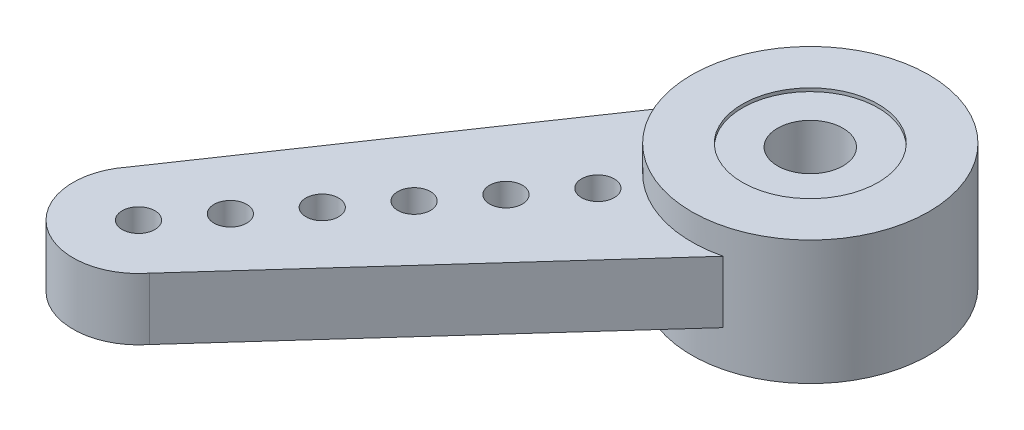
ISO-10303-21;
HEADER;
FILE_DESCRIPTION(('STEP AP214'),'2;1');
FILE_NAME('part.step','',(''),(''),'','','');
FILE_SCHEMA(('AUTOMOTIVE_DESIGN { 1 0 10303 214 1 1 1 1 }'));
ENDSEC;
DATA;
#1=APPLICATION_CONTEXT('core data for automotive mechanical design processes');
#2=APPLICATION_PROTOCOL_DEFINITION('international standard','automotive_design',2000,#1);
#3=PRODUCT_CONTEXT('',#1,'mechanical');
#4=PRODUCT('Part','Part','',(#3));
#5=PRODUCT_RELATED_PRODUCT_CATEGORY('part','',(#4));
#6=PRODUCT_DEFINITION_FORMATION('','',#4);
#7=PRODUCT_DEFINITION_CONTEXT('part definition',#1,'design');
#8=PRODUCT_DEFINITION('design','',#6,#7);
#9=PRODUCT_DEFINITION_SHAPE('','',#8);
#10=(LENGTH_UNIT() NAMED_UNIT(*) SI_UNIT(.MILLI.,.METRE.));
#11=(NAMED_UNIT(*) PLANE_ANGLE_UNIT() SI_UNIT($,.RADIAN.));
#12=(NAMED_UNIT(*) SI_UNIT($,.STERADIAN.) SOLID_ANGLE_UNIT());
#13=UNCERTAINTY_MEASURE_WITH_UNIT(LENGTH_MEASURE(1.E-05),#10,'distance_accuracy_value','');
#14=(GEOMETRIC_REPRESENTATION_CONTEXT(3) GLOBAL_UNCERTAINTY_ASSIGNED_CONTEXT((#13)) GLOBAL_UNIT_ASSIGNED_CONTEXT((#10,
#11,#12)) REPRESENTATION_CONTEXT('',''));
#15=CARTESIAN_POINT('',(0.,0.,0.));
#16=DIRECTION('',(0.,0.,1.));
#17=DIRECTION('',(1.,0.,0.));
#18=AXIS2_PLACEMENT_3D('',#15,#16,#17);
#19=CARTESIAN_POINT('',(0.,4.3,0.));
#20=DIRECTION('',(0.,-1.,0.));
#21=DIRECTION('',(0.,0.,-1.));
#22=AXIS2_PLACEMENT_3D('',#19,#20,#21);
#23=CYLINDRICAL_SURFACE('',#22,1.);
#24=CARTESIAN_POINT('',(0.,5.,0.));
#25=DIRECTION('',(0.,1.,0.));
#26=DIRECTION('',(0.,0.,1.));
#27=AXIS2_PLACEMENT_3D('',#24,#25,#26);
#28=CIRCLE('',#27,1.);
#29=CARTESIAN_POINT('',(0.,5.,1.));
#30=VERTEX_POINT('',#29);
#31=EDGE_CURVE('E171',#30,#30,#28,.T.);
#32=ORIENTED_EDGE('',*,*,#31,.T.);
#33=EDGE_LOOP('',(#32));
#34=FACE_BOUND('',#33,.T.);
#35=CARTESIAN_POINT('',(0.,3.41,0.));
#36=DIRECTION('',(0.,-1.,0.));
#37=DIRECTION('',(0.,0.,-1.));
#38=AXIS2_PLACEMENT_3D('',#35,#36,#37);
#39=CIRCLE('',#38,1.);
#40=CARTESIAN_POINT('',(0.,3.41,-1.));
#41=VERTEX_POINT('',#40);
#42=EDGE_CURVE('E177',#41,#41,#39,.T.);
#43=ORIENTED_EDGE('',*,*,#42,.T.);
#44=EDGE_LOOP('',(#43));
#45=FACE_BOUND('',#44,.T.);
#46=ADVANCED_FACE('F33',(#34,#45),#23,.F.);
#47=CARTESIAN_POINT('',(0.,2.41,0.));
#48=DIRECTION('',(0.,-1.,0.));
#49=DIRECTION('',(0.,0.,-1.));
#50=AXIS2_PLACEMENT_3D('',#47,#48,#49);
#51=CYLINDRICAL_SURFACE('',#50,3.625);
#52=CARTESIAN_POINT('',(0.,5.1,0.));
#53=DIRECTION('',(0.,1.,0.));
#54=DIRECTION('',(0.,0.,1.));
#55=AXIS2_PLACEMENT_3D('',#52,#53,#54);
#56=CIRCLE('',#55,3.625);
#57=CARTESIAN_POINT('',(0.,5.1,3.625));
#58=VERTEX_POINT('',#57);
#59=EDGE_CURVE('E157',#58,#58,#56,.T.);
#60=ORIENTED_EDGE('',*,*,#59,.F.);
#61=EDGE_LOOP('',(#60));
#62=FACE_BOUND('',#61,.T.);
#63=CARTESIAN_POINT('',(0.,2.41,0.));
#64=DIRECTION('',(0.,1.,0.));
#65=DIRECTION('',(0.,0.,1.));
#66=AXIS2_PLACEMENT_3D('',#63,#64,#65);
#67=CIRCLE('',#66,3.625);
#68=CARTESIAN_POINT('',(-3.625,2.41,0.));
#69=VERTEX_POINT('',#68);
#70=CARTESIAN_POINT('',(0.859585555161717,2.41,3.52161009672526));
#71=VERTEX_POINT('',#70);
#72=EDGE_CURVE('E48',#69,#71,#67,.T.);
#73=ORIENTED_EDGE('',*,*,#72,.F.);
#74=DIRECTION('',(0.,-1.,0.));
#75=VECTOR('',#74,1.);
#76=CARTESIAN_POINT('',(-3.625,4.3,0.));
#77=LINE('',#76,#75);
#78=CARTESIAN_POINT('',(-3.625,4.3,0.));
#79=VERTEX_POINT('',#78);
#80=EDGE_CURVE('E92',#79,#69,#77,.T.);
#81=ORIENTED_EDGE('',*,*,#80,.F.);
#82=CARTESIAN_POINT('',(0.,4.3,0.));
#83=DIRECTION('',(0.,1.,0.));
#84=DIRECTION('',(0.,0.,1.));
#85=AXIS2_PLACEMENT_3D('',#82,#83,#84);
#86=CIRCLE('',#85,3.625);
#87=CARTESIAN_POINT('',(0.859585555161719,4.3,3.52161009672526));
#88=VERTEX_POINT('',#87);
#89=EDGE_CURVE('E41',#79,#88,#86,.T.);
#90=ORIENTED_EDGE('',*,*,#89,.T.);
#91=DIRECTION('',(0.,-1.,0.));
#92=VECTOR('',#91,1.);
#93=CARTESIAN_POINT('',(0.859585555161717,4.3,3.52161009672526));
#94=LINE('',#93,#92);
#95=EDGE_CURVE('E80',#88,#71,#94,.T.);
#96=ORIENTED_EDGE('',*,*,#95,.T.);
#97=EDGE_LOOP('',(#73,#81,#90,#96));
#98=FACE_BOUND('',#97,.T.);
#99=CARTESIAN_POINT('',(0.,1.3,0.));
#100=DIRECTION('',(0.,-1.,0.));
#101=DIRECTION('',(0.,0.,-1.));
#102=AXIS2_PLACEMENT_3D('',#99,#100,#101);
#103=CIRCLE('',#102,3.625);
#104=CARTESIAN_POINT('',(0.,1.3,-3.625));
#105=VERTEX_POINT('',#104);
#106=EDGE_CURVE('E165',#105,#105,#103,.T.);
#107=ORIENTED_EDGE('',*,*,#106,.F.);
#108=EDGE_LOOP('',(#107));
#109=FACE_BOUND('',#108,.T.);
#110=ADVANCED_FACE('F35',(#62,#98,#109),#51,.T.);
#111=CARTESIAN_POINT('',(0.,2.41,0.));
#112=DIRECTION('',(0.,-1.,0.));
#113=DIRECTION('',(0.,0.,-1.));
#114=AXIS2_PLACEMENT_3D('',#111,#112,#113);
#115=CYLINDRICAL_SURFACE('',#114,2.075);
#116=CARTESIAN_POINT('',(0.,1.3,0.));
#117=DIRECTION('',(0.,-1.,0.));
#118=DIRECTION('',(0.,0.,-1.));
#119=AXIS2_PLACEMENT_3D('',#116,#117,#118);
#120=CIRCLE('',#119,2.075);
#121=CARTESIAN_POINT('',(0.,1.3,-2.075));
#122=VERTEX_POINT('',#121);
#123=EDGE_CURVE('E168',#122,#122,#120,.T.);
#124=ORIENTED_EDGE('',*,*,#123,.T.);
#125=EDGE_LOOP('',(#124));
#126=FACE_BOUND('',#125,.T.);
#127=CARTESIAN_POINT('',(0.,3.41,0.));
#128=DIRECTION('',(0.,-1.,0.));
#129=DIRECTION('',(0.,0.,-1.));
#130=AXIS2_PLACEMENT_3D('',#127,#128,#129);
#131=CIRCLE('',#130,2.075);
#132=CARTESIAN_POINT('',(0.,3.41,-2.075));
#133=VERTEX_POINT('',#132);
#134=EDGE_CURVE('E174',#133,#133,#131,.T.);
#135=ORIENTED_EDGE('',*,*,#134,.F.);
#136=EDGE_LOOP('',(#135));
#137=FACE_BOUND('',#136,.T.);
#138=ADVANCED_FACE('F189',(#126,#137),#115,.F.);
#139=CARTESIAN_POINT('',(0.,2.41,0.));
#140=DIRECTION('',(0.,1.,0.));
#141=DIRECTION('',(0.,0.,1.));
#142=AXIS2_PLACEMENT_3D('',#139,#140,#141);
#143=PLANE('',#142);
#144=CARTESIAN_POINT('',(-9.03247950828862,2.41,11.5023884012124));
#145=DIRECTION('',(0.,1.,0.));
#146=DIRECTION('',(0.,0.,1.));
#147=AXIS2_PLACEMENT_3D('',#144,#145,#146);
#148=CIRCLE('',#147,0.500000000000001);
#149=CARTESIAN_POINT('',(-9.03247950828862,2.41,12.0023884012124));
#150=VERTEX_POINT('',#149);
#151=EDGE_CURVE('E124',#150,#150,#148,.T.);
#152=ORIENTED_EDGE('',*,*,#151,.T.);
#153=EDGE_LOOP('',(#152));
#154=FACE_BOUND('',#153,.T.);
#155=CARTESIAN_POINT('',(-7.79726863536026,2.41,9.92941220959363));
#156=DIRECTION('',(0.,1.,0.));
#157=DIRECTION('',(0.,0.,1.));
#158=AXIS2_PLACEMENT_3D('',#155,#156,#157);
#159=CIRCLE('',#158,0.5);
#160=CARTESIAN_POINT('',(-7.79726863536026,2.41,10.4294122095936));
#161=VERTEX_POINT('',#160);
#162=EDGE_CURVE('E130',#161,#161,#159,.T.);
#163=ORIENTED_EDGE('',*,*,#162,.T.);
#164=EDGE_LOOP('',(#163));
#165=FACE_BOUND('',#164,.T.);
#166=CARTESIAN_POINT('',(-6.5620577624319,2.41,8.35643601797484));
#167=DIRECTION('',(0.,1.,0.));
#168=DIRECTION('',(0.,0.,1.));
#169=AXIS2_PLACEMENT_3D('',#166,#167,#168);
#170=CIRCLE('',#169,0.500000000000001);
#171=CARTESIAN_POINT('',(-6.5620577624319,2.41,8.85643601797484));
#172=VERTEX_POINT('',#171);
#173=EDGE_CURVE('E136',#172,#172,#170,.T.);
#174=ORIENTED_EDGE('',*,*,#173,.T.);
#175=EDGE_LOOP('',(#174));
#176=FACE_BOUND('',#175,.T.);
#177=CARTESIAN_POINT('',(-5.32684688950354,2.41,6.78345982635605));
#178=DIRECTION('',(0.,1.,0.));
#179=DIRECTION('',(0.,0.,1.));
#180=AXIS2_PLACEMENT_3D('',#177,#178,#179);
#181=CIRCLE('',#180,0.5);
#182=CARTESIAN_POINT('',(-5.32684688950354,2.41,7.28345982635605));
#183=VERTEX_POINT('',#182);
#184=EDGE_CURVE('E142',#183,#183,#181,.T.);
#185=ORIENTED_EDGE('',*,*,#184,.T.);
#186=EDGE_LOOP('',(#185));
#187=FACE_BOUND('',#186,.T.);
#188=CARTESIAN_POINT('',(-4.09163601657519,2.41,5.21048363473725));
#189=DIRECTION('',(0.,1.,0.));
#190=DIRECTION('',(0.,0.,1.));
#191=AXIS2_PLACEMENT_3D('',#188,#189,#190);
#192=CIRCLE('',#191,0.5);
#193=CARTESIAN_POINT('',(-4.09163601657519,2.41,5.71048363473725));
#194=VERTEX_POINT('',#193);
#195=EDGE_CURVE('E148',#194,#194,#192,.T.);
#196=ORIENTED_EDGE('',*,*,#195,.T.);
#197=EDGE_LOOP('',(#196));
#198=FACE_BOUND('',#197,.T.);
#199=CARTESIAN_POINT('',(-2.85642514364683,2.41,3.63750744311846));
#200=DIRECTION('',(0.,1.,0.));
#201=DIRECTION('',(0.,0.,1.));
#202=AXIS2_PLACEMENT_3D('',#199,#200,#201);
#203=CIRCLE('',#202,0.5);
#204=CARTESIAN_POINT('',(-2.85642514364683,2.41,4.13750744311846));
#205=VERTEX_POINT('',#204);
#206=EDGE_CURVE('E154',#205,#205,#203,.T.);
#207=ORIENTED_EDGE('',*,*,#206,.T.);
#208=EDGE_LOOP('',(#207));
#209=FACE_BOUND('',#208,.T.);
#210=DIRECTION('',(-0.562242548605768,0.,0.826972379549215));
#211=VECTOR('',#210,1.);
#212=CARTESIAN_POINT('',(-10.6054556999074,2.41,10.2671775282841));
#213=LINE('',#212,#211);
#214=CARTESIAN_POINT('',(-10.6054556999074,2.41,10.2671775282841));
#215=VERTEX_POINT('',#214);
#216=EDGE_CURVE('E108',#69,#215,#213,.T.);
#217=ORIENTED_EDGE('',*,*,#216,.F.);
#218=ORIENTED_EDGE('',*,*,#72,.T.);
#219=DIRECTION('',(0.670063091932306,0.,-0.742304151160505));
#220=VECTOR('',#219,1.);
#221=CARTESIAN_POINT('',(-7.45950331666982,2.41,12.7375992741408));
#222=LINE('',#221,#220);
#223=CARTESIAN_POINT('',(-7.45950331666982,2.41,12.7375992741408));
#224=VERTEX_POINT('',#223);
#225=EDGE_CURVE('E84',#224,#71,#222,.T.);
#226=ORIENTED_EDGE('',*,*,#225,.F.);
#227=CARTESIAN_POINT('',(-9.03247950828862,2.41,11.5023884012124));
#228=DIRECTION('',(0.,1.,0.));
#229=DIRECTION('',(0.,0.,1.));
#230=AXIS2_PLACEMENT_3D('',#227,#228,#229);
#231=CIRCLE('',#230,2.);
#232=EDGE_CURVE('E110',#215,#224,#231,.T.);
#233=ORIENTED_EDGE('',*,*,#232,.F.);
#234=EDGE_LOOP('',(#217,#218,#226,#233));
#235=FACE_BOUND('',#234,.T.);
#236=ADVANCED_FACE('F191',(#154,#165,#176,#187,#198,#209,#235),#143,.F.);
#237=CARTESIAN_POINT('',(0.,4.3,0.));
#238=DIRECTION('',(0.,1.,0.));
#239=DIRECTION('',(0.,0.,1.));
#240=AXIS2_PLACEMENT_3D('',#237,#238,#239);
#241=PLANE('',#240);
#242=ORIENTED_EDGE('',*,*,#89,.F.);
#243=DIRECTION('',(-0.562242548605768,0.,0.826972379549215));
#244=VECTOR('',#243,1.);
#245=CARTESIAN_POINT('',(-10.6054556999074,4.3,10.2671775282841));
#246=LINE('',#245,#244);
#247=CARTESIAN_POINT('',(-10.6054556999074,4.3,10.2671775282841));
#248=VERTEX_POINT('',#247);
#249=EDGE_CURVE('E99',#79,#248,#246,.T.);
#250=ORIENTED_EDGE('',*,*,#249,.T.);
#251=CARTESIAN_POINT('',(-9.03247950828862,4.3,11.5023884012124));
#252=DIRECTION('',(0.,1.,0.));
#253=DIRECTION('',(0.,0.,1.));
#254=AXIS2_PLACEMENT_3D('',#251,#252,#253);
#255=CIRCLE('',#254,2.);
#256=CARTESIAN_POINT('',(-7.45950331666982,4.3,12.7375992741408));
#257=VERTEX_POINT('',#256);
#258=EDGE_CURVE('E57',#248,#257,#255,.T.);
#259=ORIENTED_EDGE('',*,*,#258,.T.);
#260=DIRECTION('',(0.670063091932306,0.,-0.742304151160505));
#261=VECTOR('',#260,1.);
#262=CARTESIAN_POINT('',(-7.45950331666982,4.3,12.7375992741408));
#263=LINE('',#262,#261);
#264=EDGE_CURVE('E83',#257,#88,#263,.T.);
#265=ORIENTED_EDGE('',*,*,#264,.T.);
#266=EDGE_LOOP('',(#242,#250,#259,#265));
#267=FACE_BOUND('',#266,.T.);
#268=CARTESIAN_POINT('',(-4.09163601657519,4.3,5.21048363473725));
#269=DIRECTION('',(0.,1.,0.));
#270=DIRECTION('',(0.,0.,1.));
#271=AXIS2_PLACEMENT_3D('',#268,#269,#270);
#272=CIRCLE('',#271,0.5);
#273=CARTESIAN_POINT('',(-4.09163601657519,4.3,5.71048363473725));
#274=VERTEX_POINT('',#273);
#275=EDGE_CURVE('E145',#274,#274,#272,.T.);
#276=ORIENTED_EDGE('',*,*,#275,.F.);
#277=EDGE_LOOP('',(#276));
#278=FACE_BOUND('',#277,.T.);
#279=CARTESIAN_POINT('',(-6.5620577624319,4.3,8.35643601797484));
#280=DIRECTION('',(0.,1.,0.));
#281=DIRECTION('',(0.,0.,1.));
#282=AXIS2_PLACEMENT_3D('',#279,#280,#281);
#283=CIRCLE('',#282,0.500000000000001);
#284=CARTESIAN_POINT('',(-6.5620577624319,4.3,8.85643601797484));
#285=VERTEX_POINT('',#284);
#286=EDGE_CURVE('E133',#285,#285,#283,.T.);
#287=ORIENTED_EDGE('',*,*,#286,.F.);
#288=EDGE_LOOP('',(#287));
#289=FACE_BOUND('',#288,.T.);
#290=CARTESIAN_POINT('',(-9.03247950828862,4.3,11.5023884012124));
#291=DIRECTION('',(0.,1.,0.));
#292=DIRECTION('',(0.,0.,1.));
#293=AXIS2_PLACEMENT_3D('',#290,#291,#292);
#294=CIRCLE('',#293,0.500000000000001);
#295=CARTESIAN_POINT('',(-9.03247950828862,4.3,12.0023884012124));
#296=VERTEX_POINT('',#295);
#297=EDGE_CURVE('E111',#296,#296,#294,.T.);
#298=ORIENTED_EDGE('',*,*,#297,.F.);
#299=EDGE_LOOP('',(#298));
#300=FACE_BOUND('',#299,.T.);
#301=CARTESIAN_POINT('',(-7.79726863536026,4.3,9.92941220959363));
#302=DIRECTION('',(0.,1.,0.));
#303=DIRECTION('',(0.,0.,1.));
#304=AXIS2_PLACEMENT_3D('',#301,#302,#303);
#305=CIRCLE('',#304,0.5);
#306=CARTESIAN_POINT('',(-7.79726863536026,4.3,10.4294122095936));
#307=VERTEX_POINT('',#306);
#308=EDGE_CURVE('E127',#307,#307,#305,.T.);
#309=ORIENTED_EDGE('',*,*,#308,.F.);
#310=EDGE_LOOP('',(#309));
#311=FACE_BOUND('',#310,.T.);
#312=CARTESIAN_POINT('',(-5.32684688950354,4.3,6.78345982635605));
#313=DIRECTION('',(0.,1.,0.));
#314=DIRECTION('',(0.,0.,1.));
#315=AXIS2_PLACEMENT_3D('',#312,#313,#314);
#316=CIRCLE('',#315,0.5);
#317=CARTESIAN_POINT('',(-5.32684688950354,4.3,7.28345982635605));
#318=VERTEX_POINT('',#317);
#319=EDGE_CURVE('E139',#318,#318,#316,.T.);
#320=ORIENTED_EDGE('',*,*,#319,.F.);
#321=EDGE_LOOP('',(#320));
#322=FACE_BOUND('',#321,.T.);
#323=CARTESIAN_POINT('',(-2.85642514364683,4.3,3.63750744311846));
#324=DIRECTION('',(0.,1.,0.));
#325=DIRECTION('',(0.,0.,1.));
#326=AXIS2_PLACEMENT_3D('',#323,#324,#325);
#327=CIRCLE('',#326,0.5);
#328=CARTESIAN_POINT('',(-2.85642514364683,4.3,4.13750744311846));
#329=VERTEX_POINT('',#328);
#330=EDGE_CURVE('E151',#329,#329,#327,.T.);
#331=ORIENTED_EDGE('',*,*,#330,.F.);
#332=EDGE_LOOP('',(#331));
#333=FACE_BOUND('',#332,.T.);
#334=ADVANCED_FACE('F87',(#267,#278,#289,#300,#311,#322,#333),#241,.T.);
#335=CARTESIAN_POINT('',(-10.6054556999074,4.3,10.2671775282841));
#336=DIRECTION('',(0.826972379549215,0.,0.562242548605768));
#337=DIRECTION('',(0.562242548605768,0.,-0.826972379549215));
#338=AXIS2_PLACEMENT_3D('',#335,#336,#337);
#339=PLANE('',#338);
#340=ORIENTED_EDGE('',*,*,#216,.T.);
#341=DIRECTION('',(0.,-1.,0.));
#342=VECTOR('',#341,1.);
#343=CARTESIAN_POINT('',(-10.6054556999074,4.3,10.2671775282841));
#344=LINE('',#343,#342);
#345=EDGE_CURVE('E105',#248,#215,#344,.T.);
#346=ORIENTED_EDGE('',*,*,#345,.F.);
#347=ORIENTED_EDGE('',*,*,#249,.F.);
#348=ORIENTED_EDGE('',*,*,#80,.T.);
#349=EDGE_LOOP('',(#340,#346,#347,#348));
#350=FACE_BOUND('',#349,.T.);
#351=ADVANCED_FACE('F213',(#350),#339,.F.);
#352=CARTESIAN_POINT('',(-9.03247950828862,4.3,11.5023884012124));
#353=DIRECTION('',(0.,-1.,0.));
#354=DIRECTION('',(0.,0.,-1.));
#355=AXIS2_PLACEMENT_3D('',#352,#353,#354);
#356=CYLINDRICAL_SURFACE('',#355,2.);
#357=ORIENTED_EDGE('',*,*,#232,.T.);
#358=DIRECTION('',(0.,-1.,0.));
#359=VECTOR('',#358,1.);
#360=CARTESIAN_POINT('',(-7.45950331666982,4.3,12.7375992741408));
#361=LINE('',#360,#359);
#362=EDGE_CURVE('E85',#257,#224,#361,.T.);
#363=ORIENTED_EDGE('',*,*,#362,.F.);
#364=ORIENTED_EDGE('',*,*,#258,.F.);
#365=ORIENTED_EDGE('',*,*,#345,.T.);
#366=EDGE_LOOP('',(#357,#363,#364,#365));
#367=FACE_BOUND('',#366,.T.);
#368=ADVANCED_FACE('F217',(#367),#356,.T.);
#369=CARTESIAN_POINT('',(-7.45950331666982,4.3,12.7375992741408));
#370=DIRECTION('',(-0.742304151160505,0.,-0.670063091932306));
#371=DIRECTION('',(-0.670063091932306,0.,0.742304151160505));
#372=AXIS2_PLACEMENT_3D('',#369,#370,#371);
#373=PLANE('',#372);
#374=ORIENTED_EDGE('',*,*,#225,.T.);
#375=ORIENTED_EDGE('',*,*,#95,.F.);
#376=ORIENTED_EDGE('',*,*,#264,.F.);
#377=ORIENTED_EDGE('',*,*,#362,.T.);
#378=EDGE_LOOP('',(#374,#375,#376,#377));
#379=FACE_BOUND('',#378,.T.);
#380=ADVANCED_FACE('F81',(#379),#373,.F.);
#381=CARTESIAN_POINT('',(-9.03247950828862,4.3,11.5023884012124));
#382=DIRECTION('',(0.,-1.,0.));
#383=DIRECTION('',(0.,0.,-1.));
#384=AXIS2_PLACEMENT_3D('',#381,#382,#383);
#385=CYLINDRICAL_SURFACE('',#384,0.500000000000001);
#386=ORIENTED_EDGE('',*,*,#297,.T.);
#387=EDGE_LOOP('',(#386));
#388=FACE_BOUND('',#387,.T.);
#389=ORIENTED_EDGE('',*,*,#151,.F.);
#390=EDGE_LOOP('',(#389));
#391=FACE_BOUND('',#390,.T.);
#392=ADVANCED_FACE('F210',(#388,#391),#385,.F.);
#393=CARTESIAN_POINT('',(-7.79726863536026,4.3,9.92941220959363));
#394=DIRECTION('',(0.,-1.,0.));
#395=DIRECTION('',(0.,0.,-1.));
#396=AXIS2_PLACEMENT_3D('',#393,#394,#395);
#397=CYLINDRICAL_SURFACE('',#396,0.5);
#398=ORIENTED_EDGE('',*,*,#308,.T.);
#399=EDGE_LOOP('',(#398));
#400=FACE_BOUND('',#399,.T.);
#401=ORIENTED_EDGE('',*,*,#162,.F.);
#402=EDGE_LOOP('',(#401));
#403=FACE_BOUND('',#402,.T.);
#404=ADVANCED_FACE('F244',(#400,#403),#397,.F.);
#405=CARTESIAN_POINT('',(-6.5620577624319,4.3,8.35643601797484));
#406=DIRECTION('',(0.,-1.,0.));
#407=DIRECTION('',(0.,0.,-1.));
#408=AXIS2_PLACEMENT_3D('',#405,#406,#407);
#409=CYLINDRICAL_SURFACE('',#408,0.500000000000001);
#410=ORIENTED_EDGE('',*,*,#286,.T.);
#411=EDGE_LOOP('',(#410));
#412=FACE_BOUND('',#411,.T.);
#413=ORIENTED_EDGE('',*,*,#173,.F.);
#414=EDGE_LOOP('',(#413));
#415=FACE_BOUND('',#414,.T.);
#416=ADVANCED_FACE('F251',(#412,#415),#409,.F.);
#417=CARTESIAN_POINT('',(-5.32684688950354,4.3,6.78345982635605));
#418=DIRECTION('',(0.,-1.,0.));
#419=DIRECTION('',(0.,0.,-1.));
#420=AXIS2_PLACEMENT_3D('',#417,#418,#419);
#421=CYLINDRICAL_SURFACE('',#420,0.5);
#422=ORIENTED_EDGE('',*,*,#319,.T.);
#423=EDGE_LOOP('',(#422));
#424=FACE_BOUND('',#423,.T.);
#425=ORIENTED_EDGE('',*,*,#184,.F.);
#426=EDGE_LOOP('',(#425));
#427=FACE_BOUND('',#426,.T.);
#428=ADVANCED_FACE('F258',(#424,#427),#421,.F.);
#429=CARTESIAN_POINT('',(-4.09163601657519,4.3,5.21048363473725));
#430=DIRECTION('',(0.,-1.,0.));
#431=DIRECTION('',(0.,0.,-1.));
#432=AXIS2_PLACEMENT_3D('',#429,#430,#431);
#433=CYLINDRICAL_SURFACE('',#432,0.5);
#434=ORIENTED_EDGE('',*,*,#275,.T.);
#435=EDGE_LOOP('',(#434));
#436=FACE_BOUND('',#435,.T.);
#437=ORIENTED_EDGE('',*,*,#195,.F.);
#438=EDGE_LOOP('',(#437));
#439=FACE_BOUND('',#438,.T.);
#440=ADVANCED_FACE('F266',(#436,#439),#433,.F.);
#441=CARTESIAN_POINT('',(-2.85642514364683,4.3,3.63750744311846));
#442=DIRECTION('',(0.,-1.,0.));
#443=DIRECTION('',(0.,0.,-1.));
#444=AXIS2_PLACEMENT_3D('',#441,#442,#443);
#445=CYLINDRICAL_SURFACE('',#444,0.5);
#446=ORIENTED_EDGE('',*,*,#330,.T.);
#447=EDGE_LOOP('',(#446));
#448=FACE_BOUND('',#447,.T.);
#449=ORIENTED_EDGE('',*,*,#206,.F.);
#450=EDGE_LOOP('',(#449));
#451=FACE_BOUND('',#450,.T.);
#452=ADVANCED_FACE('F274',(#448,#451),#445,.F.);
#453=CARTESIAN_POINT('',(0.,5.1,0.));
#454=DIRECTION('',(0.,1.,0.));
#455=DIRECTION('',(0.,0.,1.));
#456=AXIS2_PLACEMENT_3D('',#453,#454,#455);
#457=PLANE('',#456);
#458=ORIENTED_EDGE('',*,*,#59,.T.);
#459=EDGE_LOOP('',(#458));
#460=FACE_BOUND('',#459,.T.);
#461=CARTESIAN_POINT('',(0.,5.1,0.));
#462=DIRECTION('',(0.,1.,0.));
#463=DIRECTION('',(0.,0.,1.));
#464=AXIS2_PLACEMENT_3D('',#461,#462,#463);
#465=CIRCLE('',#464,2.075);
#466=CARTESIAN_POINT('',(0.,5.1,2.075));
#467=VERTEX_POINT('',#466);
#468=EDGE_CURVE('E162',#467,#467,#465,.T.);
#469=ORIENTED_EDGE('',*,*,#468,.F.);
#470=EDGE_LOOP('',(#469));
#471=FACE_BOUND('',#470,.T.);
#472=ADVANCED_FACE('F282',(#460,#471),#457,.T.);
#473=CARTESIAN_POINT('',(0.,5.1,0.));
#474=DIRECTION('',(0.,-1.,0.));
#475=DIRECTION('',(0.,0.,-1.));
#476=AXIS2_PLACEMENT_3D('',#473,#474,#475);
#477=CYLINDRICAL_SURFACE('',#476,2.075);
#478=CARTESIAN_POINT('',(0.,5.,0.));
#479=DIRECTION('',(0.,1.,0.));
#480=DIRECTION('',(0.,0.,1.));
#481=AXIS2_PLACEMENT_3D('',#478,#479,#480);
#482=CIRCLE('',#481,2.075);
#483=CARTESIAN_POINT('',(0.,5.,2.075));
#484=VERTEX_POINT('',#483);
#485=EDGE_CURVE('E11',#484,#484,#482,.T.);
#486=ORIENTED_EDGE('',*,*,#485,.F.);
#487=EDGE_LOOP('',(#486));
#488=FACE_BOUND('',#487,.T.);
#489=ORIENTED_EDGE('',*,*,#468,.T.);
#490=EDGE_LOOP('',(#489));
#491=FACE_BOUND('',#490,.T.);
#492=ADVANCED_FACE('F289',(#488,#491),#477,.F.);
#493=CARTESIAN_POINT('',(0.,1.3,0.));
#494=DIRECTION('',(0.,-1.,0.));
#495=DIRECTION('',(0.,0.,-1.));
#496=AXIS2_PLACEMENT_3D('',#493,#494,#495);
#497=PLANE('',#496);
#498=ORIENTED_EDGE('',*,*,#123,.F.);
#499=EDGE_LOOP('',(#498));
#500=FACE_BOUND('',#499,.T.);
#501=ORIENTED_EDGE('',*,*,#106,.T.);
#502=EDGE_LOOP('',(#501));
#503=FACE_BOUND('',#502,.T.);
#504=ADVANCED_FACE('F298',(#500,#503),#497,.T.);
#505=CARTESIAN_POINT('',(0.,5.,0.));
#506=DIRECTION('',(0.,1.,0.));
#507=DIRECTION('',(0.,0.,1.));
#508=AXIS2_PLACEMENT_3D('',#505,#506,#507);
#509=PLANE('',#508);
#510=ORIENTED_EDGE('',*,*,#485,.T.);
#511=EDGE_LOOP('',(#510));
#512=FACE_BOUND('',#511,.T.);
#513=ORIENTED_EDGE('',*,*,#31,.F.);
#514=EDGE_LOOP('',(#513));
#515=FACE_BOUND('',#514,.T.);
#516=ADVANCED_FACE('F185',(#512,#515),#509,.T.);
#517=CARTESIAN_POINT('',(0.,3.41,0.));
#518=DIRECTION('',(0.,-1.,0.));
#519=DIRECTION('',(0.,0.,-1.));
#520=AXIS2_PLACEMENT_3D('',#517,#518,#519);
#521=PLANE('',#520);
#522=ORIENTED_EDGE('',*,*,#42,.F.);
#523=EDGE_LOOP('',(#522));
#524=FACE_BOUND('',#523,.T.);
#525=ORIENTED_EDGE('',*,*,#134,.T.);
#526=EDGE_LOOP('',(#525));
#527=FACE_BOUND('',#526,.T.);
#528=ADVANCED_FACE('F182',(#524,#527),#521,.T.);
#529=CLOSED_SHELL('',(#46,#110,#138,#236,#334,#351,#368,#380,#392,#404,#416,#428,#440,#452,#472,
#492,#504,#516,#528));
#530=MANIFOLD_SOLID_BREP('B2',#529);
#531=ADVANCED_BREP_SHAPE_REPRESENTATION('',(#18,#530),#14);
#532=SHAPE_DEFINITION_REPRESENTATION(#9,#531);
ENDSEC;
END-ISO-10303-21;
